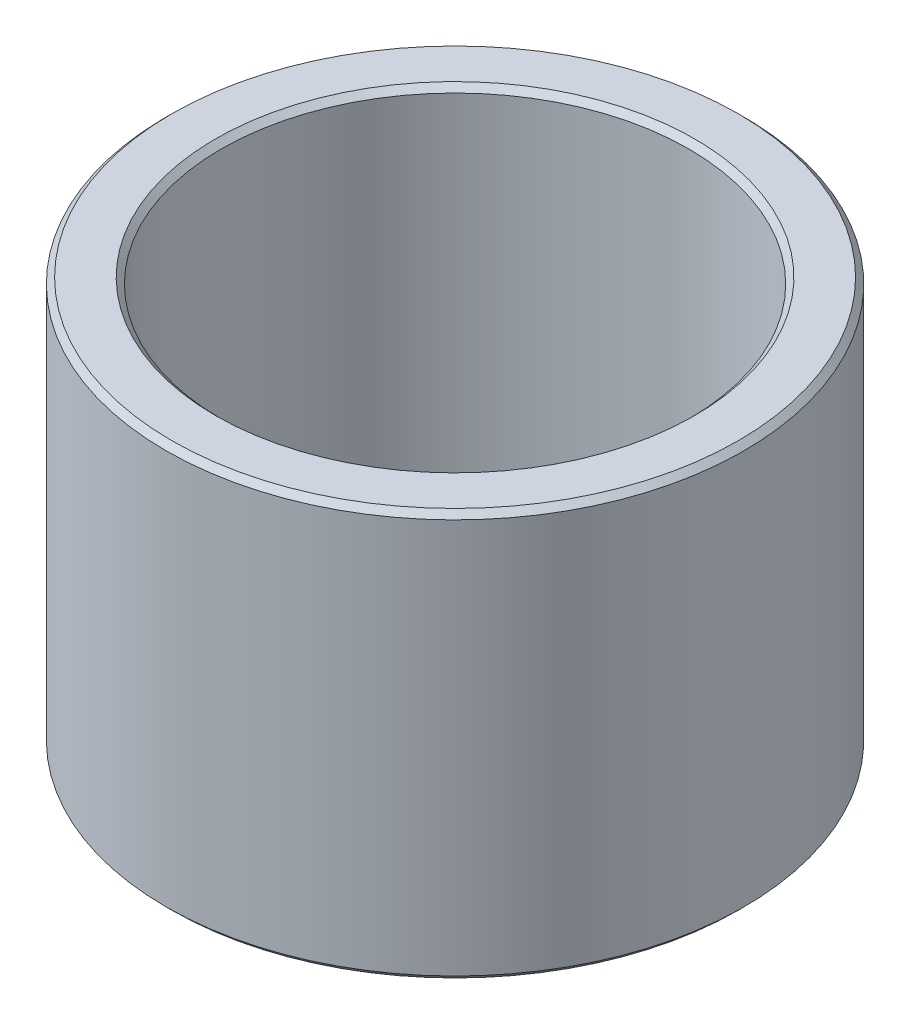
ISO-10303-21;
HEADER;
FILE_DESCRIPTION(('STEP AP214'),'2;1');
FILE_NAME('part.step','',(''),(''),'','','');
FILE_SCHEMA(('AUTOMOTIVE_DESIGN { 1 0 10303 214 1 1 1 1 }'));
ENDSEC;
DATA;
#1=APPLICATION_CONTEXT('core data for automotive mechanical design processes');
#2=APPLICATION_PROTOCOL_DEFINITION('international standard','automotive_design',2000,#1);
#3=PRODUCT_CONTEXT('',#1,'mechanical');
#4=PRODUCT('Part','Part','',(#3));
#5=PRODUCT_RELATED_PRODUCT_CATEGORY('part','',(#4));
#6=PRODUCT_DEFINITION_FORMATION('','',#4);
#7=PRODUCT_DEFINITION_CONTEXT('part definition',#1,'design');
#8=PRODUCT_DEFINITION('design','',#6,#7);
#9=PRODUCT_DEFINITION_SHAPE('','',#8);
#10=(LENGTH_UNIT() NAMED_UNIT(*) SI_UNIT(.MILLI.,.METRE.));
#11=(NAMED_UNIT(*) PLANE_ANGLE_UNIT() SI_UNIT($,.RADIAN.));
#12=(NAMED_UNIT(*) SI_UNIT($,.STERADIAN.) SOLID_ANGLE_UNIT());
#13=UNCERTAINTY_MEASURE_WITH_UNIT(LENGTH_MEASURE(1.E-05),#10,'distance_accuracy_value','');
#14=(GEOMETRIC_REPRESENTATION_CONTEXT(3) GLOBAL_UNCERTAINTY_ASSIGNED_CONTEXT((#13)) GLOBAL_UNIT_ASSIGNED_CONTEXT((#10,
#11,#12)) REPRESENTATION_CONTEXT('',''));
#15=CARTESIAN_POINT('',(0.,0.,0.));
#16=DIRECTION('',(0.,0.,1.));
#17=DIRECTION('',(1.,0.,0.));
#18=AXIS2_PLACEMENT_3D('',#15,#16,#17);
#19=CARTESIAN_POINT('',(0.,3.5,0.));
#20=DIRECTION('',(0.,1.,0.));
#21=DIRECTION('',(0.,0.,1.));
#22=AXIS2_PLACEMENT_3D('',#19,#20,#21);
#23=PLANE('',#22);
#24=CARTESIAN_POINT('',(0.,3.5,0.));
#25=DIRECTION('',(0.,1.,0.));
#26=DIRECTION('',(0.,0.,1.));
#27=AXIS2_PLACEMENT_3D('',#24,#25,#26);
#28=CIRCLE('',#27,4.875);
#29=CARTESIAN_POINT('',(0.,3.5,4.875));
#30=VERTEX_POINT('',#29);
#31=EDGE_CURVE('E41',#30,#30,#28,.T.);
#32=ORIENTED_EDGE('',*,*,#31,.T.);
#33=EDGE_LOOP('',(#32));
#34=FACE_BOUND('',#33,.T.);
#35=CARTESIAN_POINT('',(0.,3.5,0.));
#36=DIRECTION('',(0.,1.,0.));
#37=DIRECTION('',(0.,0.,1.));
#38=AXIS2_PLACEMENT_3D('',#35,#36,#37);
#39=CIRCLE('',#38,4.125);
#40=CARTESIAN_POINT('',(0.,3.5,4.125));
#41=VERTEX_POINT('',#40);
#42=EDGE_CURVE('E45',#41,#41,#39,.F.);
#43=ORIENTED_EDGE('',*,*,#42,.T.);
#44=EDGE_LOOP('',(#43));
#45=FACE_BOUND('',#44,.T.);
#46=ADVANCED_FACE('F30',(#34,#45),#23,.T.);
#47=CARTESIAN_POINT('',(0.,-3.5,0.));
#48=DIRECTION('',(0.,1.,0.));
#49=DIRECTION('',(0.,0.,1.));
#50=AXIS2_PLACEMENT_3D('',#47,#48,#49);
#51=PLANE('',#50);
#52=CARTESIAN_POINT('',(0.,-3.5,0.));
#53=DIRECTION('',(0.,1.,0.));
#54=DIRECTION('',(0.,0.,1.));
#55=AXIS2_PLACEMENT_3D('',#52,#53,#54);
#56=CIRCLE('',#55,4.875);
#57=CARTESIAN_POINT('',(0.,-3.5,4.875));
#58=VERTEX_POINT('',#57);
#59=EDGE_CURVE('E50',#58,#58,#56,.F.);
#60=ORIENTED_EDGE('',*,*,#59,.T.);
#61=EDGE_LOOP('',(#60));
#62=FACE_BOUND('',#61,.T.);
#63=CARTESIAN_POINT('',(0.,-3.5,0.));
#64=DIRECTION('',(0.,1.,0.));
#65=DIRECTION('',(0.,0.,1.));
#66=AXIS2_PLACEMENT_3D('',#63,#64,#65);
#67=CIRCLE('',#66,4.125);
#68=CARTESIAN_POINT('',(0.,-3.5,4.125));
#69=VERTEX_POINT('',#68);
#70=EDGE_CURVE('E53',#69,#69,#67,.T.);
#71=ORIENTED_EDGE('',*,*,#70,.T.);
#72=EDGE_LOOP('',(#71));
#73=FACE_BOUND('',#72,.T.);
#74=ADVANCED_FACE('F75',(#62,#73),#51,.F.);
#75=CARTESIAN_POINT('',(0.,3.5,0.));
#76=DIRECTION('',(0.,-1.,0.));
#77=DIRECTION('',(0.,0.,-1.));
#78=AXIS2_PLACEMENT_3D('',#75,#76,#77);
#79=CYLINDRICAL_SURFACE('',#78,4.975);
#80=CARTESIAN_POINT('',(0.,-3.4,0.));
#81=DIRECTION('',(0.,1.,0.));
#82=DIRECTION('',(0.,0.,1.));
#83=AXIS2_PLACEMENT_3D('',#80,#81,#82);
#84=CIRCLE('',#83,4.975);
#85=CARTESIAN_POINT('',(0.,-3.4,4.975));
#86=VERTEX_POINT('',#85);
#87=EDGE_CURVE('E56',#86,#86,#84,.T.);
#88=ORIENTED_EDGE('',*,*,#87,.T.);
#89=EDGE_LOOP('',(#88));
#90=FACE_BOUND('',#89,.T.);
#91=CARTESIAN_POINT('',(0.,3.4,0.));
#92=DIRECTION('',(0.,1.,0.));
#93=DIRECTION('',(0.,0.,1.));
#94=AXIS2_PLACEMENT_3D('',#91,#92,#93);
#95=CIRCLE('',#94,4.975);
#96=CARTESIAN_POINT('',(0.,3.4,4.975));
#97=VERTEX_POINT('',#96);
#98=EDGE_CURVE('E59',#97,#97,#95,.F.);
#99=ORIENTED_EDGE('',*,*,#98,.T.);
#100=EDGE_LOOP('',(#99));
#101=FACE_BOUND('',#100,.T.);
#102=ADVANCED_FACE('F63',(#90,#101),#79,.T.);
#103=CARTESIAN_POINT('',(0.,3.5,0.));
#104=DIRECTION('',(0.,-1.,0.));
#105=DIRECTION('',(0.,0.,-1.));
#106=AXIS2_PLACEMENT_3D('',#103,#104,#105);
#107=CYLINDRICAL_SURFACE('',#106,4.025);
#108=CARTESIAN_POINT('',(0.,-3.4,0.));
#109=DIRECTION('',(0.,1.,0.));
#110=DIRECTION('',(0.,0.,1.));
#111=AXIS2_PLACEMENT_3D('',#108,#109,#110);
#112=CIRCLE('',#111,4.025);
#113=CARTESIAN_POINT('',(0.,-3.4,4.025));
#114=VERTEX_POINT('',#113);
#115=EDGE_CURVE('E10',#114,#114,#112,.F.);
#116=ORIENTED_EDGE('',*,*,#115,.T.);
#117=EDGE_LOOP('',(#116));
#118=FACE_BOUND('',#117,.T.);
#119=CARTESIAN_POINT('',(0.,3.4,0.));
#120=DIRECTION('',(0.,1.,0.));
#121=DIRECTION('',(0.,0.,1.));
#122=AXIS2_PLACEMENT_3D('',#119,#120,#121);
#123=CIRCLE('',#122,4.025);
#124=CARTESIAN_POINT('',(0.,3.4,4.025));
#125=VERTEX_POINT('',#124);
#126=EDGE_CURVE('E37',#125,#125,#123,.T.);
#127=ORIENTED_EDGE('',*,*,#126,.T.);
#128=EDGE_LOOP('',(#127));
#129=FACE_BOUND('',#128,.T.);
#130=ADVANCED_FACE('F91',(#118,#129),#107,.F.);
#131=CARTESIAN_POINT('',(0.,-3.4,0.));
#132=DIRECTION('',(0.,1.,0.));
#133=DIRECTION('',(0.,0.,1.));
#134=AXIS2_PLACEMENT_3D('',#131,#132,#133);
#135=CONICAL_SURFACE('',#134,4.975,0.785398163397457);
#136=ORIENTED_EDGE('',*,*,#59,.F.);
#137=EDGE_LOOP('',(#136));
#138=FACE_BOUND('',#137,.T.);
#139=ORIENTED_EDGE('',*,*,#87,.F.);
#140=EDGE_LOOP('',(#139));
#141=FACE_BOUND('',#140,.T.);
#142=ADVANCED_FACE('F69',(#138,#141),#135,.T.);
#143=CARTESIAN_POINT('',(0.,3.5,0.));
#144=DIRECTION('',(0.,-1.,0.));
#145=DIRECTION('',(0.,0.,-1.));
#146=AXIS2_PLACEMENT_3D('',#143,#144,#145);
#147=CONICAL_SURFACE('',#146,4.875,0.785398163397461);
#148=ORIENTED_EDGE('',*,*,#98,.F.);
#149=EDGE_LOOP('',(#148));
#150=FACE_BOUND('',#149,.T.);
#151=ORIENTED_EDGE('',*,*,#31,.F.);
#152=EDGE_LOOP('',(#151));
#153=FACE_BOUND('',#152,.T.);
#154=ADVANCED_FACE('F65',(#150,#153),#147,.T.);
#155=CARTESIAN_POINT('',(0.,-3.5,0.));
#156=DIRECTION('',(0.,-1.,0.));
#157=DIRECTION('',(0.,0.,-1.));
#158=AXIS2_PLACEMENT_3D('',#155,#156,#157);
#159=CONICAL_SURFACE('',#158,4.125,0.785398163397457);
#160=ORIENTED_EDGE('',*,*,#115,.F.);
#161=EDGE_LOOP('',(#160));
#162=FACE_BOUND('',#161,.T.);
#163=ORIENTED_EDGE('',*,*,#70,.F.);
#164=EDGE_LOOP('',(#163));
#165=FACE_BOUND('',#164,.T.);
#166=ADVANCED_FACE('F68',(#162,#165),#159,.F.);
#167=CARTESIAN_POINT('',(0.,3.4,0.));
#168=DIRECTION('',(0.,1.,0.));
#169=DIRECTION('',(0.,0.,1.));
#170=AXIS2_PLACEMENT_3D('',#167,#168,#169);
#171=CONICAL_SURFACE('',#170,4.025,0.785398163397444);
#172=ORIENTED_EDGE('',*,*,#42,.F.);
#173=EDGE_LOOP('',(#172));
#174=FACE_BOUND('',#173,.T.);
#175=ORIENTED_EDGE('',*,*,#126,.F.);
#176=EDGE_LOOP('',(#175));
#177=FACE_BOUND('',#176,.T.);
#178=ADVANCED_FACE('F32',(#174,#177),#171,.F.);
#179=CLOSED_SHELL('',(#46,#74,#102,#130,#142,#154,#166,#178));
#180=MANIFOLD_SOLID_BREP('B2',#179);
#181=ADVANCED_BREP_SHAPE_REPRESENTATION('',(#18,#180),#14);
#182=SHAPE_DEFINITION_REPRESENTATION(#9,#181);
ENDSEC;
END-ISO-10303-21;
